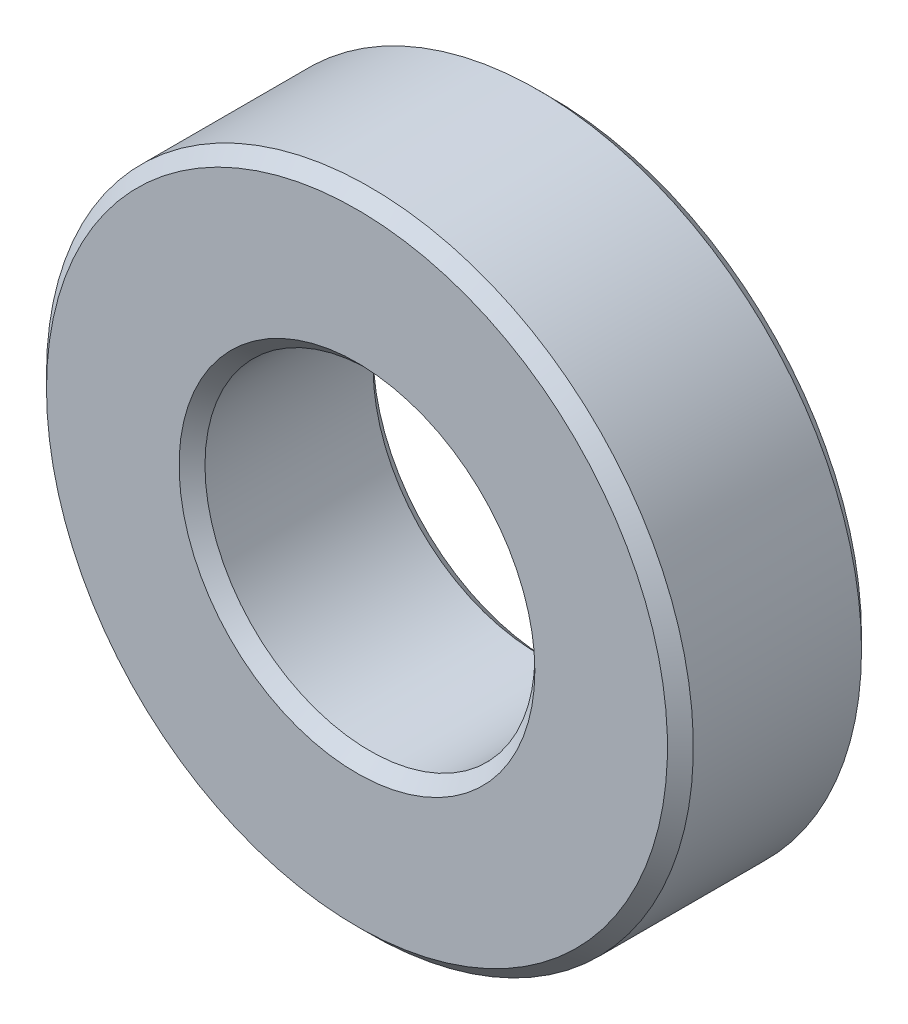
ISO-10303-21;
HEADER;
FILE_DESCRIPTION(('STEP AP214'),'2;1');
FILE_NAME('part.step','',(''),(''),'','','');
FILE_SCHEMA(('AUTOMOTIVE_DESIGN { 1 0 10303 214 1 1 1 1 }'));
ENDSEC;
DATA;
#1=APPLICATION_CONTEXT('core data for automotive mechanical design processes');
#2=APPLICATION_PROTOCOL_DEFINITION('international standard','automotive_design',2000,#1);
#3=PRODUCT_CONTEXT('',#1,'mechanical');
#4=PRODUCT('Part','Part','',(#3));
#5=PRODUCT_RELATED_PRODUCT_CATEGORY('part','',(#4));
#6=PRODUCT_DEFINITION_FORMATION('','',#4);
#7=PRODUCT_DEFINITION_CONTEXT('part definition',#1,'design');
#8=PRODUCT_DEFINITION('design','',#6,#7);
#9=PRODUCT_DEFINITION_SHAPE('','',#8);
#10=(LENGTH_UNIT() NAMED_UNIT(*) SI_UNIT(.MILLI.,.METRE.));
#11=(NAMED_UNIT(*) PLANE_ANGLE_UNIT() SI_UNIT($,.RADIAN.));
#12=(NAMED_UNIT(*) SI_UNIT($,.STERADIAN.) SOLID_ANGLE_UNIT());
#13=UNCERTAINTY_MEASURE_WITH_UNIT(LENGTH_MEASURE(1.E-05),#10,'distance_accuracy_value','');
#14=(GEOMETRIC_REPRESENTATION_CONTEXT(3) GLOBAL_UNCERTAINTY_ASSIGNED_CONTEXT((#13)) GLOBAL_UNIT_ASSIGNED_CONTEXT((#10,
#11,#12)) REPRESENTATION_CONTEXT('',''));
#15=CARTESIAN_POINT('',(0.,0.,0.));
#16=DIRECTION('',(0.,0.,1.));
#17=DIRECTION('',(1.,0.,0.));
#18=AXIS2_PLACEMENT_3D('',#15,#16,#17);
#19=CARTESIAN_POINT('',(0.,0.,3.));
#20=DIRECTION('',(0.,0.,-1.));
#21=DIRECTION('',(-1.,0.,0.));
#22=AXIS2_PLACEMENT_3D('',#19,#20,#21);
#23=CYLINDRICAL_SURFACE('',#22,2.55);
#24=CARTESIAN_POINT('',(0.,0.,0.199999999949796));
#25=DIRECTION('',(0.,0.,-1.));
#26=DIRECTION('',(-1.,0.,0.));
#27=AXIS2_PLACEMENT_3D('',#24,#25,#26);
#28=CIRCLE('',#27,2.55000000004202);
#29=CARTESIAN_POINT('',(-2.55000000004202,0.,0.199999999949796));
#30=VERTEX_POINT('',#29);
#31=EDGE_CURVE('E35',#30,#30,#28,.T.);
#32=ORIENTED_EDGE('',*,*,#31,.T.);
#33=EDGE_LOOP('',(#32));
#34=FACE_BOUND('',#33,.T.);
#35=CARTESIAN_POINT('',(0.,0.,2.80000000003611));
#36=DIRECTION('',(0.,0.,1.));
#37=DIRECTION('',(1.,0.,0.));
#38=AXIS2_PLACEMENT_3D('',#35,#36,#37);
#39=CIRCLE('',#38,2.55000000004202);
#40=CARTESIAN_POINT('',(2.55000000004202,0.,2.80000000003611));
#41=VERTEX_POINT('',#40);
#42=EDGE_CURVE('E32',#41,#41,#39,.T.);
#43=ORIENTED_EDGE('',*,*,#42,.T.);
#44=EDGE_LOOP('',(#43));
#45=FACE_BOUND('',#44,.T.);
#46=ADVANCED_FACE('F15',(#34,#45),#23,.F.);
#47=CARTESIAN_POINT('',(0.,0.,1.13686837721616E-10));
#48=DIRECTION('',(0.,0.,-1.));
#49=DIRECTION('',(-1.,0.,0.));
#50=AXIS2_PLACEMENT_3D('',#47,#48,#49);
#51=CONICAL_SURFACE('',#50,2.74999999993497,0.785398163539557);
#52=CARTESIAN_POINT('',(0.,0.,5.68434188769639E-11));
#53=DIRECTION('',(0.,0.,-1.));
#54=DIRECTION('',(-1.,0.,0.));
#55=AXIS2_PLACEMENT_3D('',#52,#53,#54);
#56=CIRCLE('',#55,2.74999999999181);
#57=CARTESIAN_POINT('',(-2.74999999999181,0.,5.68434188769639E-11));
#58=VERTEX_POINT('',#57);
#59=EDGE_CURVE('E18',#58,#58,#56,.T.);
#60=ORIENTED_EDGE('',*,*,#59,.T.);
#61=EDGE_LOOP('',(#60));
#62=FACE_BOUND('',#61,.T.);
#63=ORIENTED_EDGE('',*,*,#31,.F.);
#64=EDGE_LOOP('',(#63));
#65=FACE_BOUND('',#64,.T.);
#66=ADVANCED_FACE('F49',(#62,#65),#51,.F.);
#67=CARTESIAN_POINT('',(0.,0.,2.9999999999859));
#68=DIRECTION('',(0.,0.,1.));
#69=DIRECTION('',(1.,0.,0.));
#70=AXIS2_PLACEMENT_3D('',#67,#68,#69);
#71=CONICAL_SURFACE('',#70,2.74999999999181,0.785398163397448);
#72=CARTESIAN_POINT('',(0.,0.,2.9999999999859));
#73=DIRECTION('',(0.,0.,1.));
#74=DIRECTION('',(1.,0.,0.));
#75=AXIS2_PLACEMENT_3D('',#72,#73,#74);
#76=CIRCLE('',#75,2.74999999999181);
#77=CARTESIAN_POINT('',(2.74999999999181,0.,2.9999999999859));
#78=VERTEX_POINT('',#77);
#79=EDGE_CURVE('E42',#78,#78,#76,.F.);
#80=ORIENTED_EDGE('',*,*,#79,.F.);
#81=EDGE_LOOP('',(#80));
#82=FACE_BOUND('',#81,.T.);
#83=ORIENTED_EDGE('',*,*,#42,.F.);
#84=EDGE_LOOP('',(#83));
#85=FACE_BOUND('',#84,.T.);
#86=ADVANCED_FACE('F56',(#82,#85),#71,.F.);
#87=CARTESIAN_POINT('',(0.,0.,0.));
#88=DIRECTION('',(0.,0.,1.));
#89=DIRECTION('',(1.,0.,0.));
#90=AXIS2_PLACEMENT_3D('',#87,#88,#89);
#91=PLANE('',#90);
#92=ORIENTED_EDGE('',*,*,#59,.F.);
#93=EDGE_LOOP('',(#92));
#94=FACE_BOUND('',#93,.T.);
#95=CARTESIAN_POINT('',(0.,0.,0.));
#96=DIRECTION('',(0.,0.,1.));
#97=DIRECTION('',(1.,0.,0.));
#98=AXIS2_PLACEMENT_3D('',#95,#96,#97);
#99=CIRCLE('',#98,4.80000000004566);
#100=CARTESIAN_POINT('',(4.80000000004566,0.,0.));
#101=VERTEX_POINT('',#100);
#102=EDGE_CURVE('E40',#101,#101,#99,.T.);
#103=ORIENTED_EDGE('',*,*,#102,.F.);
#104=EDGE_LOOP('',(#103));
#105=FACE_BOUND('',#104,.T.);
#106=ADVANCED_FACE('F52',(#94,#105),#91,.F.);
#107=CARTESIAN_POINT('',(0.,0.,3.));
#108=DIRECTION('',(0.,0.,1.));
#109=DIRECTION('',(1.,0.,0.));
#110=AXIS2_PLACEMENT_3D('',#107,#108,#109);
#111=PLANE('',#110);
#112=ORIENTED_EDGE('',*,*,#79,.T.);
#113=EDGE_LOOP('',(#112));
#114=FACE_BOUND('',#113,.T.);
#115=CARTESIAN_POINT('',(0.,0.,2.9999999999859));
#116=DIRECTION('',(0.,0.,-1.));
#117=DIRECTION('',(-1.,0.,0.));
#118=AXIS2_PLACEMENT_3D('',#115,#116,#117);
#119=CIRCLE('',#118,4.79999999998881);
#120=CARTESIAN_POINT('',(-4.79999999998881,0.,2.9999999999859));
#121=VERTEX_POINT('',#120);
#122=EDGE_CURVE('E27',#121,#121,#119,.T.);
#123=ORIENTED_EDGE('',*,*,#122,.F.);
#124=EDGE_LOOP('',(#123));
#125=FACE_BOUND('',#124,.T.);
#126=ADVANCED_FACE('F55',(#114,#125),#111,.T.);
#127=CARTESIAN_POINT('',(0.,0.,0.200000000006639));
#128=DIRECTION('',(0.,0.,1.));
#129=DIRECTION('',(1.,0.,0.));
#130=AXIS2_PLACEMENT_3D('',#127,#128,#129);
#131=CONICAL_SURFACE('',#130,5.0000000000523,0.785398163397448);
#132=ORIENTED_EDGE('',*,*,#102,.T.);
#133=EDGE_LOOP('',(#132));
#134=FACE_BOUND('',#133,.T.);
#135=CARTESIAN_POINT('',(0.,0.,0.199999999999999));
#136=DIRECTION('',(0.,0.,-1.));
#137=DIRECTION('',(-1.,0.,0.));
#138=AXIS2_PLACEMENT_3D('',#135,#136,#137);
#139=CIRCLE('',#138,5.);
#140=CARTESIAN_POINT('',(-5.,0.,0.199999999999999));
#141=VERTEX_POINT('',#140);
#142=EDGE_CURVE('E22',#141,#141,#139,.F.);
#143=ORIENTED_EDGE('',*,*,#142,.F.);
#144=EDGE_LOOP('',(#143));
#145=FACE_BOUND('',#144,.T.);
#146=ADVANCED_FACE('F60',(#134,#145),#131,.T.);
#147=CARTESIAN_POINT('',(0.,0.,2.80000000009295));
#148=DIRECTION('',(0.,0.,-1.));
#149=DIRECTION('',(-1.,0.,0.));
#150=AXIS2_PLACEMENT_3D('',#147,#148,#149);
#151=CONICAL_SURFACE('',#150,4.99999999988177,0.785398163397448);
#152=ORIENTED_EDGE('',*,*,#122,.T.);
#153=EDGE_LOOP('',(#152));
#154=FACE_BOUND('',#153,.T.);
#155=CARTESIAN_POINT('',(0.,0.,2.8));
#156=DIRECTION('',(0.,0.,-1.));
#157=DIRECTION('',(-1.,0.,0.));
#158=AXIS2_PLACEMENT_3D('',#155,#156,#157);
#159=CIRCLE('',#158,5.);
#160=CARTESIAN_POINT('',(-5.,0.,2.8));
#161=VERTEX_POINT('',#160);
#162=EDGE_CURVE('E10',#161,#161,#159,.T.);
#163=ORIENTED_EDGE('',*,*,#162,.F.);
#164=EDGE_LOOP('',(#163));
#165=FACE_BOUND('',#164,.T.);
#166=ADVANCED_FACE('F63',(#154,#165),#151,.T.);
#167=CARTESIAN_POINT('',(0.,0.,3.));
#168=DIRECTION('',(0.,0.,-1.));
#169=DIRECTION('',(-1.,0.,0.));
#170=AXIS2_PLACEMENT_3D('',#167,#168,#169);
#171=CYLINDRICAL_SURFACE('',#170,5.);
#172=ORIENTED_EDGE('',*,*,#162,.T.);
#173=EDGE_LOOP('',(#172));
#174=FACE_BOUND('',#173,.T.);
#175=ORIENTED_EDGE('',*,*,#142,.T.);
#176=EDGE_LOOP('',(#175));
#177=FACE_BOUND('',#176,.T.);
#178=ADVANCED_FACE('F67',(#174,#177),#171,.T.);
#179=CLOSED_SHELL('',(#46,#66,#86,#106,#126,#146,#166,#178));
#180=MANIFOLD_SOLID_BREP('B1',#179);
#181=ADVANCED_BREP_SHAPE_REPRESENTATION('',(#18,#180),#14);
#182=SHAPE_DEFINITION_REPRESENTATION(#9,#181);
ENDSEC;
END-ISO-10303-21;
